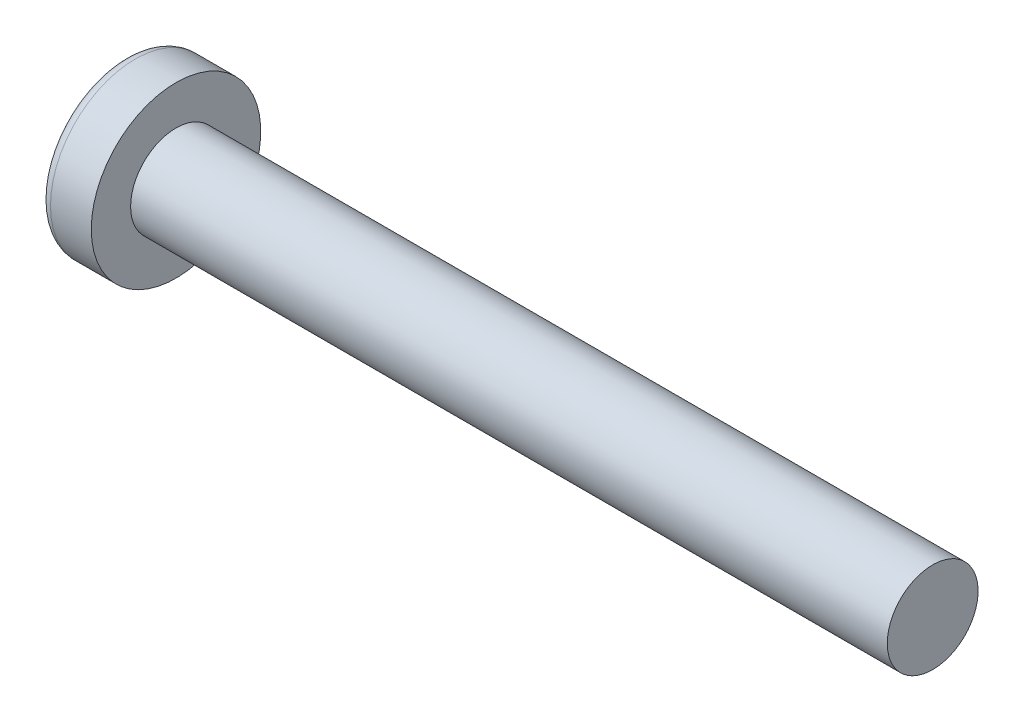
ISO-10303-21;
HEADER;
FILE_DESCRIPTION(('STEP AP214'),'2;1');
FILE_NAME('part.step','',(''),(''),'','','');
FILE_SCHEMA(('AUTOMOTIVE_DESIGN { 1 0 10303 214 1 1 1 1 }'));
ENDSEC;
DATA;
#1=APPLICATION_CONTEXT('core data for automotive mechanical design processes');
#2=APPLICATION_PROTOCOL_DEFINITION('international standard','automotive_design',2000,#1);
#3=PRODUCT_CONTEXT('',#1,'mechanical');
#4=PRODUCT('Part','Part','',(#3));
#5=PRODUCT_RELATED_PRODUCT_CATEGORY('part','',(#4));
#6=PRODUCT_DEFINITION_FORMATION('','',#4);
#7=PRODUCT_DEFINITION_CONTEXT('part definition',#1,'design');
#8=PRODUCT_DEFINITION('design','',#6,#7);
#9=PRODUCT_DEFINITION_SHAPE('','',#8);
#10=(LENGTH_UNIT() NAMED_UNIT(*) SI_UNIT(.MILLI.,.METRE.));
#11=(NAMED_UNIT(*) PLANE_ANGLE_UNIT() SI_UNIT($,.RADIAN.));
#12=(NAMED_UNIT(*) SI_UNIT($,.STERADIAN.) SOLID_ANGLE_UNIT());
#13=UNCERTAINTY_MEASURE_WITH_UNIT(LENGTH_MEASURE(1.E-05),#10,'distance_accuracy_value','');
#14=(GEOMETRIC_REPRESENTATION_CONTEXT(3) GLOBAL_UNCERTAINTY_ASSIGNED_CONTEXT((#13)) GLOBAL_UNIT_ASSIGNED_CONTEXT((#10,
#11,#12)) REPRESENTATION_CONTEXT('',''));
#15=CARTESIAN_POINT('',(0.,0.,0.));
#16=DIRECTION('',(0.,0.,1.));
#17=DIRECTION('',(1.,0.,0.));
#18=AXIS2_PLACEMENT_3D('',#15,#16,#17);
#19=CARTESIAN_POINT('',(5.,0.,0.));
#20=DIRECTION('',(-1.,0.,0.));
#21=DIRECTION('',(0.,1.,0.));
#22=AXIS2_PLACEMENT_3D('',#19,#20,#21);
#23=SPHERICAL_SURFACE('',#22,5.);
#24=CARTESIAN_POINT('',(0.74715070681048,0.,0.));
#25=DIRECTION('',(-1.,0.,0.));
#26=DIRECTION('',(0.,0.,1.));
#27=AXIS2_PLACEMENT_3D('',#24,#25,#26);
#28=CIRCLE('',#27,2.62931034482759);
#29=CARTESIAN_POINT('',(0.74715070681048,0.,2.62931034482759));
#30=VERTEX_POINT('',#29);
#31=EDGE_CURVE('E157',#30,#30,#28,.T.);
#32=ORIENTED_EDGE('',*,*,#31,.T.);
#33=EDGE_LOOP('',(#32));
#34=FACE_BOUND('',#33,.T.);
#35=CARTESIAN_POINT('',(4.98382636322272,-0.153868112043298,0.));
#36=DIRECTION('',(-0.104537710696287,-0.994520923380891,0.));
#37=DIRECTION('',(0.994520923380891,-0.104537710696287,0.));
#38=AXIS2_PLACEMENT_3D('',#35,#36,#37);
#39=CIRCLE('',#38,4.99760572850336);
#40=CARTESIAN_POINT('',(0.188596138461546,0.350175974082162,1.31444652548076));
#41=VERTEX_POINT('',#40);
#42=CARTESIAN_POINT('',(0.0270341343313624,0.367158343834486,0.367158343834487));
#43=VERTEX_POINT('',#42);
#44=EDGE_CURVE('E188',#41,#43,#39,.T.);
#45=ORIENTED_EDGE('',*,*,#44,.F.);
#46=CARTESIAN_POINT('',(3.98403090792016,0.,-1.41352221506761));
#47=DIRECTION('',(0.583636048152575,0.,0.812015371342713));
#48=DIRECTION('',(0.812015371342714,0.,-0.583636048152575));
#49=AXIS2_PLACEMENT_3D('',#46,#47,#48);
#50=CIRCLE('',#49,4.68719124331927);
#51=CARTESIAN_POINT('',(0.188596138461545,-0.350175974082172,1.31444652548076));
#52=VERTEX_POINT('',#51);
#53=EDGE_CURVE('E153',#41,#52,#50,.T.);
#54=ORIENTED_EDGE('',*,*,#53,.T.);
#55=CARTESIAN_POINT('',(4.98382636322272,0.153868112043297,0.));
#56=DIRECTION('',(-0.104537710696287,0.994520923380891,0.));
#57=DIRECTION('',(-0.994520923380891,-0.104537710696287,0.));
#58=AXIS2_PLACEMENT_3D('',#55,#56,#57);
#59=CIRCLE('',#58,4.99760572850336);
#60=CARTESIAN_POINT('',(0.0270341343313616,-0.367158343834489,0.367158343834487));
#61=VERTEX_POINT('',#60);
#62=EDGE_CURVE('E109',#61,#52,#59,.T.);
#63=ORIENTED_EDGE('',*,*,#62,.F.);
#64=CARTESIAN_POINT('',(4.98382636322272,0.,-0.153868112043297));
#65=DIRECTION('',(-0.104537710696287,0.,-0.994520923380891));
#66=DIRECTION('',(-0.994520923380891,0.,0.104537710696287));
#67=AXIS2_PLACEMENT_3D('',#64,#65,#66);
#68=CIRCLE('',#67,4.99760572850336);
#69=CARTESIAN_POINT('',(0.188596138461544,-1.31444652548077,0.350175974082167));
#70=VERTEX_POINT('',#69);
#71=EDGE_CURVE('E134',#70,#61,#68,.T.);
#72=ORIENTED_EDGE('',*,*,#71,.F.);
#73=CARTESIAN_POINT('',(3.98403090792015,1.41352221506761,0.));
#74=DIRECTION('',(0.583636048152575,-0.812015371342713,0.));
#75=DIRECTION('',(0.812015371342714,0.583636048152575,0.));
#76=AXIS2_PLACEMENT_3D('',#73,#74,#75);
#77=CIRCLE('',#76,4.68719124331927);
#78=CARTESIAN_POINT('',(0.188596138461544,-1.31444652548077,-0.350175974082167));
#79=VERTEX_POINT('',#78);
#80=EDGE_CURVE('E142',#70,#79,#77,.T.);
#81=ORIENTED_EDGE('',*,*,#80,.T.);
#82=CARTESIAN_POINT('',(4.98382636322272,0.,0.153868112043297));
#83=DIRECTION('',(-0.104537710696287,0.,0.994520923380891));
#84=DIRECTION('',(0.994520923380891,0.,0.104537710696287));
#85=AXIS2_PLACEMENT_3D('',#82,#83,#84);
#86=CIRCLE('',#85,4.99760572850336);
#87=CARTESIAN_POINT('',(0.0270341343313616,-0.367158343834486,-0.367158343834487));
#88=VERTEX_POINT('',#87);
#89=EDGE_CURVE('E52',#88,#79,#86,.T.);
#90=ORIENTED_EDGE('',*,*,#89,.F.);
#91=CARTESIAN_POINT('',(0.188596138461545,-0.350175974082162,-1.31444652548077));
#92=VERTEX_POINT('',#91);
#93=EDGE_CURVE('E195',#92,#88,#59,.T.);
#94=ORIENTED_EDGE('',*,*,#93,.F.);
#95=CARTESIAN_POINT('',(3.98403090792016,0.,1.41352221506761));
#96=DIRECTION('',(0.583636048152575,0.,-0.812015371342713));
#97=DIRECTION('',(-0.812015371342714,0.,-0.583636048152575));
#98=AXIS2_PLACEMENT_3D('',#95,#96,#97);
#99=CIRCLE('',#98,4.68719124331927);
#100=CARTESIAN_POINT('',(0.188596138461546,0.350175974082172,-1.31444652548076));
#101=VERTEX_POINT('',#100);
#102=EDGE_CURVE('E135',#92,#101,#99,.T.);
#103=ORIENTED_EDGE('',*,*,#102,.T.);
#104=CARTESIAN_POINT('',(0.0270341343313624,0.367158343834489,-0.367158343834487));
#105=VERTEX_POINT('',#104);
#106=EDGE_CURVE('E183',#105,#101,#39,.T.);
#107=ORIENTED_EDGE('',*,*,#106,.F.);
#108=CARTESIAN_POINT('',(0.188596138461546,1.31444652548076,-0.350175974082167));
#109=VERTEX_POINT('',#108);
#110=EDGE_CURVE('E45',#109,#105,#86,.T.);
#111=ORIENTED_EDGE('',*,*,#110,.F.);
#112=CARTESIAN_POINT('',(3.98403090792016,-1.41352221506761,0.));
#113=DIRECTION('',(0.583636048152575,0.812015371342713,0.));
#114=DIRECTION('',(-0.812015371342714,0.583636048152575,0.));
#115=AXIS2_PLACEMENT_3D('',#112,#113,#114);
#116=CIRCLE('',#115,4.68719124331927);
#117=CARTESIAN_POINT('',(0.188596138461546,1.31444652548076,0.350175974082167));
#118=VERTEX_POINT('',#117);
#119=EDGE_CURVE('E11',#109,#118,#116,.T.);
#120=ORIENTED_EDGE('',*,*,#119,.T.);
#121=EDGE_CURVE('E171',#43,#118,#68,.T.);
#122=ORIENTED_EDGE('',*,*,#121,.F.);
#123=EDGE_LOOP('',(#45,#54,#63,#72,#81,#90,#94,#103,#107,#111,#120,#122));
#124=FACE_BOUND('',#123,.T.);
#125=ADVANCED_FACE('F37',(#34,#124),#23,.T.);
#126=CARTESIAN_POINT('',(2.01739130434783,0.,-0.15794466403162));
#127=DIRECTION('',(-0.104537710696287,0.,0.994520923380891));
#128=DIRECTION('',(0.994520923380891,0.,0.104537710696287));
#129=AXIS2_PLACEMENT_3D('',#126,#127,#128);
#130=PLANE('',#129);
#131=ORIENTED_EDGE('',*,*,#110,.T.);
#132=DIRECTION('',(0.989130931836555,-0.103971149085093,0.103971149085092));
#133=VECTOR('',#132,1.);
#134=CARTESIAN_POINT('',(2.03363450411053,0.156237282238383,-0.156237282238382));
#135=LINE('',#134,#133);
#136=CARTESIAN_POINT('',(1.76,0.185000000000001,-0.184999999999999));
#137=VERTEX_POINT('',#136);
#138=EDGE_CURVE('E177',#105,#137,#135,.T.);
#139=ORIENTED_EDGE('',*,*,#138,.T.);
#140=DIRECTION('',(0.80907355338853,-0.581521616498006,0.0850446632823171));
#141=VECTOR('',#140,1.);
#142=CARTESIAN_POINT('',(0.,1.45,-0.37));
#143=LINE('',#142,#141);
#144=EDGE_CURVE('E158',#109,#137,#143,.T.);
#145=ORIENTED_EDGE('',*,*,#144,.F.);
#146=EDGE_LOOP('',(#131,#139,#145));
#147=FACE_BOUND('',#146,.T.);
#148=ADVANCED_FACE('F176',(#147),#130,.T.);
#149=DIRECTION('',(0.80907355338853,0.581521616498006,0.0850446632823171));
#150=VECTOR('',#149,1.);
#151=CARTESIAN_POINT('',(0.,-1.45,-0.37));
#152=LINE('',#151,#150);
#153=CARTESIAN_POINT('',(1.76,-0.185,-0.185));
#154=VERTEX_POINT('',#153);
#155=EDGE_CURVE('E143',#79,#154,#152,.T.);
#156=ORIENTED_EDGE('',*,*,#155,.T.);
#157=DIRECTION('',(-0.989130931836555,-0.103971149085092,-0.103971149085092));
#158=VECTOR('',#157,1.);
#159=CARTESIAN_POINT('',(2.03363450411053,-0.156237282238382,-0.156237282238382));
#160=LINE('',#159,#158);
#161=EDGE_CURVE('E198',#154,#88,#160,.T.);
#162=ORIENTED_EDGE('',*,*,#161,.T.);
#163=ORIENTED_EDGE('',*,*,#89,.T.);
#164=EDGE_LOOP('',(#156,#162,#163));
#165=FACE_BOUND('',#164,.T.);
#166=ADVANCED_FACE('F213',(#165),#130,.T.);
#167=CARTESIAN_POINT('',(2.01739130434783,0.,0.157944664031621));
#168=DIRECTION('',(-0.104537710696287,0.,-0.994520923380891));
#169=DIRECTION('',(-0.994520923380891,0.,0.104537710696287));
#170=AXIS2_PLACEMENT_3D('',#167,#168,#169);
#171=PLANE('',#170);
#172=DIRECTION('',(0.80907355338853,-0.581521616498006,-0.085044663282317));
#173=VECTOR('',#172,1.);
#174=CARTESIAN_POINT('',(0.,1.45,0.37));
#175=LINE('',#174,#173);
#176=CARTESIAN_POINT('',(1.76,0.185,0.185));
#177=VERTEX_POINT('',#176);
#178=EDGE_CURVE('E214',#118,#177,#175,.T.);
#179=ORIENTED_EDGE('',*,*,#178,.T.);
#180=DIRECTION('',(-0.989130931836555,0.103971149085092,0.103971149085092));
#181=VECTOR('',#180,1.);
#182=CARTESIAN_POINT('',(2.03363450411053,0.156237282238382,0.156237282238382));
#183=LINE('',#182,#181);
#184=EDGE_CURVE('E192',#177,#43,#183,.T.);
#185=ORIENTED_EDGE('',*,*,#184,.T.);
#186=ORIENTED_EDGE('',*,*,#121,.T.);
#187=EDGE_LOOP('',(#179,#185,#186));
#188=FACE_BOUND('',#187,.T.);
#189=ADVANCED_FACE('F218',(#188),#171,.T.);
#190=ORIENTED_EDGE('',*,*,#71,.T.);
#191=DIRECTION('',(0.989130931836555,0.103971149085093,-0.103971149085092));
#192=VECTOR('',#191,1.);
#193=CARTESIAN_POINT('',(2.03363450411053,-0.156237282238383,0.156237282238382));
#194=LINE('',#193,#192);
#195=CARTESIAN_POINT('',(1.76,-0.185000000000001,0.184999999999999));
#196=VERTEX_POINT('',#195);
#197=EDGE_CURVE('E107',#61,#196,#194,.T.);
#198=ORIENTED_EDGE('',*,*,#197,.T.);
#199=DIRECTION('',(0.80907355338853,0.581521616498006,-0.0850446632823169));
#200=VECTOR('',#199,1.);
#201=CARTESIAN_POINT('',(0.,-1.45,0.37));
#202=LINE('',#201,#200);
#203=EDGE_CURVE('E132',#70,#196,#202,.T.);
#204=ORIENTED_EDGE('',*,*,#203,.F.);
#205=EDGE_LOOP('',(#190,#198,#204));
#206=FACE_BOUND('',#205,.T.);
#207=ADVANCED_FACE('F131',(#206),#171,.T.);
#208=CARTESIAN_POINT('',(-25.4,0.,0.));
#209=DIRECTION('',(-1.,0.,0.));
#210=DIRECTION('',(0.,0.,1.));
#211=AXIS2_PLACEMENT_3D('',#208,#209,#210);
#212=CYLINDRICAL_SURFACE('',#211,1.5);
#213=CARTESIAN_POINT('',(27.4,0.,0.));
#214=DIRECTION('',(-1.,0.,0.));
#215=DIRECTION('',(0.,0.,1.));
#216=AXIS2_PLACEMENT_3D('',#213,#214,#215);
#217=CIRCLE('',#216,1.5);
#218=CARTESIAN_POINT('',(27.4,0.,1.5));
#219=VERTEX_POINT('',#218);
#220=EDGE_CURVE('E154',#219,#219,#217,.T.);
#221=ORIENTED_EDGE('',*,*,#220,.T.);
#222=EDGE_LOOP('',(#221));
#223=FACE_BOUND('',#222,.T.);
#224=CARTESIAN_POINT('',(2.4,0.,0.));
#225=DIRECTION('',(-1.,0.,0.));
#226=DIRECTION('',(0.,0.,1.));
#227=AXIS2_PLACEMENT_3D('',#224,#225,#226);
#228=CIRCLE('',#227,1.5);
#229=CARTESIAN_POINT('',(2.4,0.,1.5));
#230=VERTEX_POINT('',#229);
#231=EDGE_CURVE('E167',#230,#230,#228,.T.);
#232=ORIENTED_EDGE('',*,*,#231,.F.);
#233=EDGE_LOOP('',(#232));
#234=FACE_BOUND('',#233,.T.);
#235=ADVANCED_FACE('F39',(#223,#234),#212,.T.);
#236=CARTESIAN_POINT('',(2.4,1.5,0.));
#237=DIRECTION('',(-1.,0.,0.));
#238=DIRECTION('',(0.,0.,1.));
#239=AXIS2_PLACEMENT_3D('',#236,#237,#238);
#240=PLANE('',#239);
#241=CARTESIAN_POINT('',(2.4,0.,0.));
#242=DIRECTION('',(-1.,0.,0.));
#243=DIRECTION('',(0.,0.,1.));
#244=AXIS2_PLACEMENT_3D('',#241,#242,#243);
#245=CIRCLE('',#244,2.8);
#246=CARTESIAN_POINT('',(2.4,0.,2.8));
#247=VERTEX_POINT('',#246);
#248=EDGE_CURVE('E164',#247,#247,#245,.T.);
#249=ORIENTED_EDGE('',*,*,#248,.F.);
#250=EDGE_LOOP('',(#249));
#251=FACE_BOUND('',#250,.T.);
#252=ORIENTED_EDGE('',*,*,#231,.T.);
#253=EDGE_LOOP('',(#252));
#254=FACE_BOUND('',#253,.T.);
#255=ADVANCED_FACE('F246',(#251,#254),#240,.F.);
#256=CARTESIAN_POINT('',(-25.4,0.,0.));
#257=DIRECTION('',(-1.,0.,0.));
#258=DIRECTION('',(0.,0.,1.));
#259=AXIS2_PLACEMENT_3D('',#256,#257,#258);
#260=CYLINDRICAL_SURFACE('',#259,2.8);
#261=ORIENTED_EDGE('',*,*,#248,.T.);
#262=EDGE_LOOP('',(#261));
#263=FACE_BOUND('',#262,.T.);
#264=CARTESIAN_POINT('',(1.05335585592013,0.,0.));
#265=DIRECTION('',(-1.,0.,0.));
#266=DIRECTION('',(0.,0.,1.));
#267=AXIS2_PLACEMENT_3D('',#264,#265,#266);
#268=CIRCLE('',#267,2.8);
#269=CARTESIAN_POINT('',(1.05335585592013,0.,2.8));
#270=VERTEX_POINT('',#269);
#271=EDGE_CURVE('E161',#270,#270,#268,.T.);
#272=ORIENTED_EDGE('',*,*,#271,.F.);
#273=EDGE_LOOP('',(#272));
#274=FACE_BOUND('',#273,.T.);
#275=ADVANCED_FACE('F243',(#263,#274),#260,.T.);
#276=CARTESIAN_POINT('',(1.05335585592012,0.,0.));
#277=DIRECTION('',(-1.,0.,0.));
#278=DIRECTION('',(0.,0.,1.));
#279=AXIS2_PLACEMENT_3D('',#276,#277,#278);
#280=TOROIDAL_SURFACE('',#279,2.44,0.36);
#281=ORIENTED_EDGE('',*,*,#271,.T.);
#282=EDGE_LOOP('',(#281));
#283=FACE_BOUND('',#282,.T.);
#284=ORIENTED_EDGE('',*,*,#31,.F.);
#285=EDGE_LOOP('',(#284));
#286=FACE_BOUND('',#285,.T.);
#287=ADVANCED_FACE('F240',(#283,#286),#280,.T.);
#288=CARTESIAN_POINT('',(27.4,1.5,0.));
#289=DIRECTION('',(1.,0.,0.));
#290=DIRECTION('',(0.,0.,-1.));
#291=AXIS2_PLACEMENT_3D('',#288,#289,#290);
#292=PLANE('',#291);
#293=ORIENTED_EDGE('',*,*,#220,.F.);
#294=EDGE_LOOP('',(#293));
#295=FACE_BOUND('',#294,.T.);
#296=ADVANCED_FACE('F238',(#295),#292,.T.);
#297=CARTESIAN_POINT('',(1.76,0.185,0.185));
#298=DIRECTION('',(0.583636048152575,0.812015371342713,0.));
#299=DIRECTION('',(-0.812015371342714,0.583636048152575,0.));
#300=AXIS2_PLACEMENT_3D('',#297,#298,#299);
#301=PLANE('',#300);
#302=ORIENTED_EDGE('',*,*,#144,.T.);
#303=DIRECTION('',(0.,0.,-1.));
#304=VECTOR('',#303,1.);
#305=CARTESIAN_POINT('',(1.76,0.185,0.185));
#306=LINE('',#305,#304);
#307=EDGE_CURVE('E125',#177,#137,#306,.T.);
#308=ORIENTED_EDGE('',*,*,#307,.F.);
#309=ORIENTED_EDGE('',*,*,#178,.F.);
#310=ORIENTED_EDGE('',*,*,#119,.F.);
#311=EDGE_LOOP('',(#302,#308,#309,#310));
#312=FACE_BOUND('',#311,.T.);
#313=ADVANCED_FACE('F217',(#312),#301,.F.);
#314=CARTESIAN_POINT('',(1.76,-0.185,-0.185));
#315=DIRECTION('',(0.583636048152575,-0.812015371342713,0.));
#316=DIRECTION('',(0.812015371342714,0.583636048152575,0.));
#317=AXIS2_PLACEMENT_3D('',#314,#315,#316);
#318=PLANE('',#317);
#319=ORIENTED_EDGE('',*,*,#203,.T.);
#320=DIRECTION('',(0.,0.,1.));
#321=VECTOR('',#320,1.);
#322=CARTESIAN_POINT('',(1.76,-0.185,-0.185));
#323=LINE('',#322,#321);
#324=EDGE_CURVE('E124',#154,#196,#323,.T.);
#325=ORIENTED_EDGE('',*,*,#324,.F.);
#326=ORIENTED_EDGE('',*,*,#155,.F.);
#327=ORIENTED_EDGE('',*,*,#80,.F.);
#328=EDGE_LOOP('',(#319,#325,#326,#327));
#329=FACE_BOUND('',#328,.T.);
#330=ADVANCED_FACE('F139',(#329),#318,.F.);
#331=CARTESIAN_POINT('',(1.76,-0.185,-0.185));
#332=DIRECTION('',(1.,0.,0.));
#333=DIRECTION('',(0.,0.,-1.));
#334=AXIS2_PLACEMENT_3D('',#331,#332,#333);
#335=PLANE('',#334);
#336=DIRECTION('',(0.,1.,0.));
#337=VECTOR('',#336,1.);
#338=CARTESIAN_POINT('',(1.76,-0.185,-0.185));
#339=LINE('',#338,#337);
#340=EDGE_CURVE('E147',#154,#137,#339,.T.);
#341=ORIENTED_EDGE('',*,*,#340,.F.);
#342=ORIENTED_EDGE('',*,*,#324,.T.);
#343=DIRECTION('',(0.,-1.,0.));
#344=VECTOR('',#343,1.);
#345=CARTESIAN_POINT('',(1.76,0.185,0.185));
#346=LINE('',#345,#344);
#347=EDGE_CURVE('E116',#177,#196,#346,.T.);
#348=ORIENTED_EDGE('',*,*,#347,.F.);
#349=ORIENTED_EDGE('',*,*,#307,.T.);
#350=EDGE_LOOP('',(#341,#342,#348,#349));
#351=FACE_BOUND('',#350,.T.);
#352=ADVANCED_FACE('F145',(#351),#335,.F.);
#353=CARTESIAN_POINT('',(1.76,0.185000000000001,-0.184999999999999));
#354=DIRECTION('',(0.583636048152575,0.,-0.812015371342713));
#355=DIRECTION('',(0.812015371342714,0.,0.583636048152575));
#356=AXIS2_PLACEMENT_3D('',#353,#354,#355);
#357=PLANE('',#356);
#358=DIRECTION('',(0.80907355338853,0.0850446632823149,0.581521616498006));
#359=VECTOR('',#358,1.);
#360=CARTESIAN_POINT('',(0.,-0.369999999999994,-1.45));
#361=LINE('',#360,#359);
#362=EDGE_CURVE('E203',#92,#154,#361,.T.);
#363=ORIENTED_EDGE('',*,*,#362,.T.);
#364=ORIENTED_EDGE('',*,*,#340,.T.);
#365=DIRECTION('',(0.80907355338853,-0.0850446632823191,0.581521616498006));
#366=VECTOR('',#365,1.);
#367=CARTESIAN_POINT('',(0.,0.370000000000005,-1.45));
#368=LINE('',#367,#366);
#369=EDGE_CURVE('E113',#101,#137,#368,.T.);
#370=ORIENTED_EDGE('',*,*,#369,.F.);
#371=ORIENTED_EDGE('',*,*,#102,.F.);
#372=EDGE_LOOP('',(#363,#364,#370,#371));
#373=FACE_BOUND('',#372,.T.);
#374=ADVANCED_FACE('F208',(#373),#357,.F.);
#375=CARTESIAN_POINT('',(2.01739130434783,-0.157944664031621,0.));
#376=DIRECTION('',(-0.104537710696287,0.994520923380891,0.));
#377=DIRECTION('',(-0.994520923380891,-0.104537710696287,0.));
#378=AXIS2_PLACEMENT_3D('',#375,#376,#377);
#379=PLANE('',#378);
#380=ORIENTED_EDGE('',*,*,#93,.T.);
#381=ORIENTED_EDGE('',*,*,#161,.F.);
#382=ORIENTED_EDGE('',*,*,#362,.F.);
#383=EDGE_LOOP('',(#380,#381,#382));
#384=FACE_BOUND('',#383,.T.);
#385=ADVANCED_FACE('F212',(#384),#379,.T.);
#386=CARTESIAN_POINT('',(2.01739130434783,0.15794466403162,0.));
#387=DIRECTION('',(-0.104537710696287,-0.994520923380891,0.));
#388=DIRECTION('',(0.994520923380891,-0.104537710696287,0.));
#389=AXIS2_PLACEMENT_3D('',#386,#387,#388);
#390=PLANE('',#389);
#391=ORIENTED_EDGE('',*,*,#106,.T.);
#392=ORIENTED_EDGE('',*,*,#369,.T.);
#393=ORIENTED_EDGE('',*,*,#138,.F.);
#394=EDGE_LOOP('',(#391,#392,#393));
#395=FACE_BOUND('',#394,.T.);
#396=ADVANCED_FACE('F206',(#395),#390,.T.);
#397=CARTESIAN_POINT('',(1.76,-0.185000000000001,0.184999999999999));
#398=DIRECTION('',(0.583636048152575,0.,0.812015371342713));
#399=DIRECTION('',(-0.812015371342714,0.,0.583636048152575));
#400=AXIS2_PLACEMENT_3D('',#397,#398,#399);
#401=PLANE('',#400);
#402=DIRECTION('',(0.80907355338853,-0.0850446632823151,-0.581521616498006));
#403=VECTOR('',#402,1.);
#404=CARTESIAN_POINT('',(0.,0.369999999999995,1.45));
#405=LINE('',#404,#403);
#406=EDGE_CURVE('E112',#41,#177,#405,.T.);
#407=ORIENTED_EDGE('',*,*,#406,.T.);
#408=ORIENTED_EDGE('',*,*,#347,.T.);
#409=DIRECTION('',(0.80907355338853,0.085044663282319,-0.581521616498006));
#410=VECTOR('',#409,1.);
#411=CARTESIAN_POINT('',(0.,-0.370000000000005,1.45));
#412=LINE('',#411,#410);
#413=EDGE_CURVE('E103',#52,#196,#412,.T.);
#414=ORIENTED_EDGE('',*,*,#413,.F.);
#415=ORIENTED_EDGE('',*,*,#53,.F.);
#416=EDGE_LOOP('',(#407,#408,#414,#415));
#417=FACE_BOUND('',#416,.T.);
#418=ADVANCED_FACE('F117',(#417),#401,.F.);
#419=ORIENTED_EDGE('',*,*,#44,.T.);
#420=ORIENTED_EDGE('',*,*,#184,.F.);
#421=ORIENTED_EDGE('',*,*,#406,.F.);
#422=EDGE_LOOP('',(#419,#420,#421));
#423=FACE_BOUND('',#422,.T.);
#424=ADVANCED_FACE('F219',(#423),#390,.T.);
#425=ORIENTED_EDGE('',*,*,#62,.T.);
#426=ORIENTED_EDGE('',*,*,#413,.T.);
#427=ORIENTED_EDGE('',*,*,#197,.F.);
#428=EDGE_LOOP('',(#425,#426,#427));
#429=FACE_BOUND('',#428,.T.);
#430=ADVANCED_FACE('F105',(#429),#379,.T.);
#431=CLOSED_SHELL('',(#125,#148,#166,#189,#207,#235,#255,#275,#287,#296,#313,#330,#352,#374,
#385,#396,#418,#424,#430));
#432=MANIFOLD_SOLID_BREP('B2',#431);
#433=ADVANCED_BREP_SHAPE_REPRESENTATION('',(#18,#432),#14);
#434=SHAPE_DEFINITION_REPRESENTATION(#9,#433);
ENDSEC;
END-ISO-10303-21;
